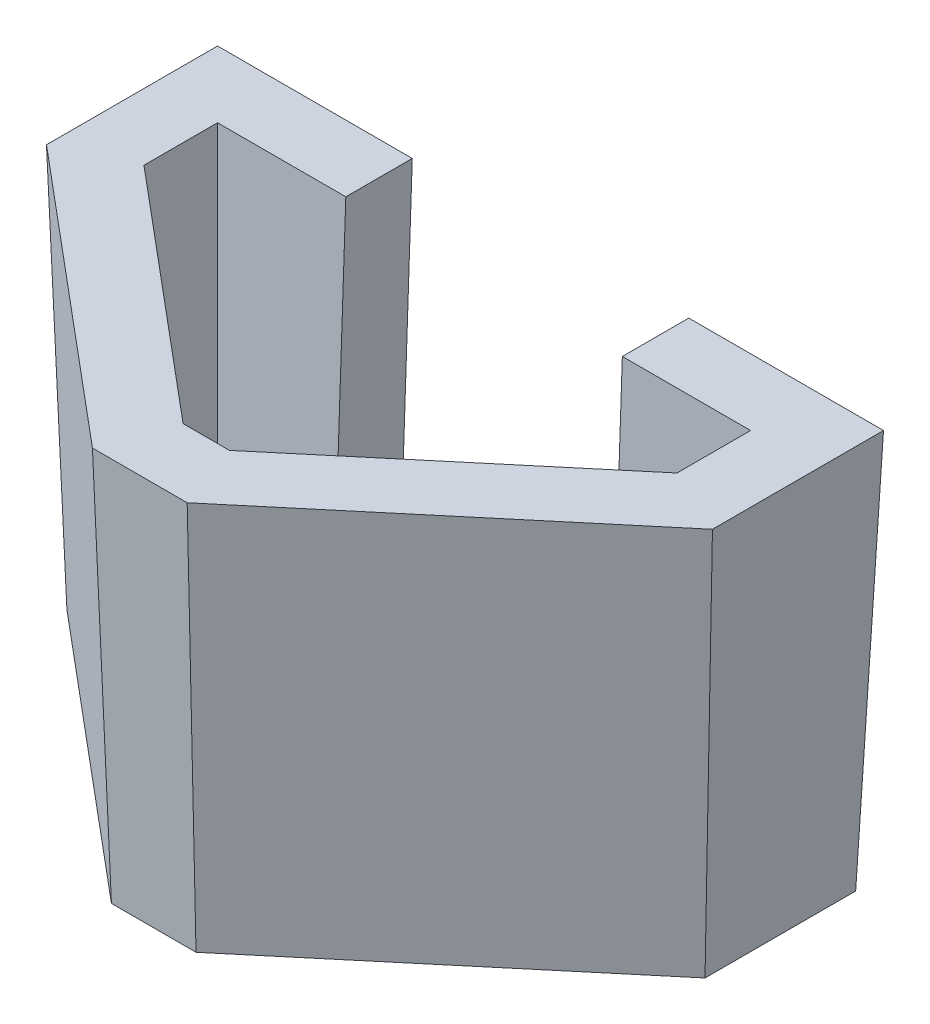
ISO-10303-21;
HEADER;
FILE_DESCRIPTION(('STEP AP214'),'2;1');
FILE_NAME('part.step','',(''),(''),'','','');
FILE_SCHEMA(('AUTOMOTIVE_DESIGN { 1 0 10303 214 1 1 1 1 }'));
ENDSEC;
DATA;
#1=APPLICATION_CONTEXT('core data for automotive mechanical design processes');
#2=APPLICATION_PROTOCOL_DEFINITION('international standard','automotive_design',2000,#1);
#3=PRODUCT_CONTEXT('',#1,'mechanical');
#4=PRODUCT('Part','Part','',(#3));
#5=PRODUCT_RELATED_PRODUCT_CATEGORY('part','',(#4));
#6=PRODUCT_DEFINITION_FORMATION('','',#4);
#7=PRODUCT_DEFINITION_CONTEXT('part definition',#1,'design');
#8=PRODUCT_DEFINITION('design','',#6,#7);
#9=PRODUCT_DEFINITION_SHAPE('','',#8);
#10=(LENGTH_UNIT() NAMED_UNIT(*) SI_UNIT(.MILLI.,.METRE.));
#11=(NAMED_UNIT(*) PLANE_ANGLE_UNIT() SI_UNIT($,.RADIAN.));
#12=(NAMED_UNIT(*) SI_UNIT($,.STERADIAN.) SOLID_ANGLE_UNIT());
#13=UNCERTAINTY_MEASURE_WITH_UNIT(LENGTH_MEASURE(1.E-05),#10,'distance_accuracy_value','');
#14=(GEOMETRIC_REPRESENTATION_CONTEXT(3) GLOBAL_UNCERTAINTY_ASSIGNED_CONTEXT((#13)) GLOBAL_UNIT_ASSIGNED_CONTEXT((#10,
#11,#12)) REPRESENTATION_CONTEXT('',''));
#15=CARTESIAN_POINT('',(0.,0.,0.));
#16=DIRECTION('',(0.,0.,1.));
#17=DIRECTION('',(1.,0.,0.));
#18=AXIS2_PLACEMENT_3D('',#15,#16,#17);
#19=CARTESIAN_POINT('',(-12.5,0.,-12.5));
#20=DIRECTION('',(0.,-0.034899496702501,-0.999390827019096));
#21=DIRECTION('',(0.,0.999390827019096,-0.034899496702501));
#22=AXIS2_PLACEMENT_3D('',#19,#20,#21);
#23=PLANE('',#22);
#24=DIRECTION('',(-1.,0.,0.));
#25=VECTOR('',#24,1.);
#26=CARTESIAN_POINT('',(-12.5,0.,-12.5));
#27=LINE('',#26,#25);
#28=CARTESIAN_POINT('',(107.5,0.,-12.5));
#29=VERTEX_POINT('',#28);
#30=CARTESIAN_POINT('',(73.5,0.,-12.5));
#31=VERTEX_POINT('',#30);
#32=EDGE_CURVE('E226',#29,#31,#27,.T.);
#33=ORIENTED_EDGE('',*,*,#32,.T.);
#34=DIRECTION('',(0.,-0.999390827019096,0.034899496702501));
#35=VECTOR('',#34,1.);
#36=CARTESIAN_POINT('',(73.5,75.4359779609008,-15.1342823977572));
#37=LINE('',#36,#35);
#38=CARTESIAN_POINT('',(73.5,75.,-15.1190577118811));
#39=VERTEX_POINT('',#38);
#40=EDGE_CURVE('E306',#39,#31,#37,.T.);
#41=ORIENTED_EDGE('',*,*,#40,.F.);
#42=DIRECTION('',(1.,0.,0.));
#43=VECTOR('',#42,1.);
#44=CARTESIAN_POINT('',(0.,75.,-15.1190577118811));
#45=LINE('',#44,#43);
#46=CARTESIAN_POINT('',(110.119057711881,75.,-15.1190577118811));
#47=VERTEX_POINT('',#46);
#48=EDGE_CURVE('E240',#47,#39,#45,.F.);
#49=ORIENTED_EDGE('',*,*,#48,.F.);
#50=DIRECTION('',(-0.0348782627423747,-0.998782765958718,0.0348782627423747));
#51=VECTOR('',#50,1.);
#52=CARTESIAN_POINT('',(107.354020814569,-4.18029692803967,-12.3540208145689));
#53=LINE('',#52,#51);
#54=EDGE_CURVE('E239',#47,#29,#53,.T.);
#55=ORIENTED_EDGE('',*,*,#54,.T.);
#56=EDGE_LOOP('',(#33,#41,#49,#55));
#57=FACE_BOUND('',#56,.T.);
#58=ADVANCED_FACE('F43',(#57),#23,.T.);
#59=CARTESIAN_POINT('',(97.6190577118811,75.,-2.61905771188108));
#60=DIRECTION('',(0.,-0.034899496702501,-0.999390827019096));
#61=DIRECTION('',(0.,0.999390827019096,-0.034899496702501));
#62=AXIS2_PLACEMENT_3D('',#59,#60,#61);
#63=PLANE('',#62);
#64=DIRECTION('',(-1.,0.,0.));
#65=VECTOR('',#64,1.);
#66=CARTESIAN_POINT('',(97.6190577118811,75.,-2.61905771188108));
#67=LINE('',#66,#65);
#68=CARTESIAN_POINT('',(97.6190577118811,75.,-2.61905771188108));
#69=VERTEX_POINT('',#68);
#70=CARTESIAN_POINT('',(73.5,75.,-2.61905771188109));
#71=VERTEX_POINT('',#70);
#72=EDGE_CURVE('E320',#69,#71,#67,.T.);
#73=ORIENTED_EDGE('',*,*,#72,.T.);
#74=DIRECTION('',(0.,-0.999390827019096,0.034899496702501));
#75=VECTOR('',#74,1.);
#76=CARTESIAN_POINT('',(73.5,75.,-2.61905771188108));
#77=LINE('',#76,#75);
#78=CARTESIAN_POINT('',(73.5,0.,0.));
#79=VERTEX_POINT('',#78);
#80=EDGE_CURVE('E11',#71,#79,#77,.T.);
#81=ORIENTED_EDGE('',*,*,#80,.T.);
#82=DIRECTION('',(-1.,0.,0.));
#83=VECTOR('',#82,1.);
#84=CARTESIAN_POINT('',(0.,0.,0.));
#85=LINE('',#84,#83);
#86=CARTESIAN_POINT('',(95.,0.,0.));
#87=VERTEX_POINT('',#86);
#88=EDGE_CURVE('E177',#87,#79,#85,.T.);
#89=ORIENTED_EDGE('',*,*,#88,.F.);
#90=DIRECTION('',(0.0348782627423747,0.998782765958718,-0.0348782627423747));
#91=VECTOR('',#90,1.);
#92=CARTESIAN_POINT('',(97.602221026892,74.5178604242078,-2.602221026892));
#93=LINE('',#92,#91);
#94=EDGE_CURVE('E214',#87,#69,#93,.T.);
#95=ORIENTED_EDGE('',*,*,#94,.T.);
#96=EDGE_LOOP('',(#73,#81,#89,#95));
#97=FACE_BOUND('',#96,.T.);
#98=ADVANCED_FACE('F362',(#97),#63,.F.);
#99=CARTESIAN_POINT('',(-12.5,0.,15.8288457269375));
#100=DIRECTION('',(-0.999390827019096,-0.034899496702501,0.));
#101=DIRECTION('',(0.034899496702501,-0.999390827019096,0.));
#102=AXIS2_PLACEMENT_3D('',#99,#100,#101);
#103=PLANE('',#102);
#104=DIRECTION('',(0.,0.,1.));
#105=VECTOR('',#104,1.);
#106=CARTESIAN_POINT('',(-12.5,0.,15.8288457269375));
#107=LINE('',#106,#105);
#108=CARTESIAN_POINT('',(-12.5,0.,-12.5));
#109=VERTEX_POINT('',#108);
#110=CARTESIAN_POINT('',(-12.5,0.,15.8288457269375));
#111=VERTEX_POINT('',#110);
#112=EDGE_CURVE('E209',#109,#111,#107,.T.);
#113=ORIENTED_EDGE('',*,*,#112,.T.);
#114=DIRECTION('',(0.034894876230547,-0.999258514013935,-0.016271748016675));
#115=VECTOR('',#114,1.);
#116=CARTESIAN_POINT('',(-12.4614234800568,-1.10468699586631,15.8108572002631));
#117=LINE('',#116,#115);
#118=CARTESIAN_POINT('',(-15.1190577118811,75.,17.0501323951376));
#119=VERTEX_POINT('',#118);
#120=EDGE_CURVE('E161',#119,#111,#117,.T.);
#121=ORIENTED_EDGE('',*,*,#120,.F.);
#122=DIRECTION('',(0.,0.,-1.));
#123=VECTOR('',#122,1.);
#124=CARTESIAN_POINT('',(-15.1190577118811,75.,0.));
#125=LINE('',#124,#123);
#126=CARTESIAN_POINT('',(-15.1190577118811,75.,-15.1190577118811));
#127=VERTEX_POINT('',#126);
#128=EDGE_CURVE('E230',#127,#119,#125,.F.);
#129=ORIENTED_EDGE('',*,*,#128,.F.);
#130=DIRECTION('',(0.0348782627423747,-0.998782765958718,0.0348782627423747));
#131=VECTOR('',#130,1.);
#132=CARTESIAN_POINT('',(-12.4655381514715,-0.986858223060223,-12.4655381514715));
#133=LINE('',#132,#131);
#134=EDGE_CURVE('E235',#127,#109,#133,.T.);
#135=ORIENTED_EDGE('',*,*,#134,.T.);
#136=EDGE_LOOP('',(#113,#121,#129,#135));
#137=FACE_BOUND('',#136,.T.);
#138=ADVANCED_FACE('F285',(#137),#103,.T.);
#139=CARTESIAN_POINT('',(39.5452549976588,0.,59.5));
#140=DIRECTION('',(-0.642396040842254,-0.034899496702501,0.765577789542062));
#141=DIRECTION('',(0.766044443118982,0.,0.642787609686535));
#142=AXIS2_PLACEMENT_3D('',#139,#140,#141);
#143=PLANE('',#142);
#144=DIRECTION('',(0.766044443118982,0.,0.642787609686535));
#145=VECTOR('',#144,1.);
#146=CARTESIAN_POINT('',(39.5452549976588,0.,59.5));
#147=LINE('',#146,#145);
#148=CARTESIAN_POINT('',(39.5452549976588,0.,59.5));
#149=VERTEX_POINT('',#148);
#150=EDGE_CURVE('E213',#111,#149,#147,.T.);
#151=ORIENTED_EDGE('',*,*,#150,.T.);
#152=DIRECTION('',(0.0127013533476481,-0.999310210716416,-0.0348966815191779));
#153=VECTOR('',#152,1.);
#154=CARTESIAN_POINT('',(39.54782158622,-0.201932666992896,59.4929483558831));
#155=LINE('',#154,#153);
#156=CARTESIAN_POINT('',(38.5919959487087,75.,62.1190577118811));
#157=VERTEX_POINT('',#156);
#158=EDGE_CURVE('E234',#157,#149,#155,.T.);
#159=ORIENTED_EDGE('',*,*,#158,.F.);
#160=DIRECTION('',(-0.766044443118982,0.,-0.642787609686535));
#161=VECTOR('',#160,1.);
#162=CARTESIAN_POINT('',(-14.6423817323938,75.,17.4501110337164));
#163=LINE('',#162,#161);
#164=EDGE_CURVE('E258',#119,#157,#163,.F.);
#165=ORIENTED_EDGE('',*,*,#164,.F.);
#166=ORIENTED_EDGE('',*,*,#120,.T.);
#167=EDGE_LOOP('',(#151,#159,#165,#166));
#168=FACE_BOUND('',#167,.T.);
#169=ADVANCED_FACE('F45',(#168),#143,.T.);
#170=CARTESIAN_POINT('',(55.4547450023412,0.,59.5));
#171=DIRECTION('',(0.,-0.034899496702501,0.999390827019096));
#172=DIRECTION('',(0.,-0.999390827019096,-0.034899496702501));
#173=AXIS2_PLACEMENT_3D('',#170,#171,#172);
#174=PLANE('',#173);
#175=DIRECTION('',(1.,0.,0.));
#176=VECTOR('',#175,1.);
#177=CARTESIAN_POINT('',(55.4547450023412,0.,59.5));
#178=LINE('',#177,#176);
#179=CARTESIAN_POINT('',(55.4547450023412,0.,59.5));
#180=VERTEX_POINT('',#179);
#181=EDGE_CURVE('E217',#149,#180,#178,.T.);
#182=ORIENTED_EDGE('',*,*,#181,.T.);
#183=DIRECTION('',(-0.0127013533476481,-0.999310210716416,-0.0348966815191779));
#184=VECTOR('',#183,1.);
#185=CARTESIAN_POINT('',(55.4437845829993,-0.862337946382392,59.4698864953504));
#186=LINE('',#185,#184);
#187=CARTESIAN_POINT('',(56.4080040512913,75.,62.1190577118811));
#188=VERTEX_POINT('',#187);
#189=EDGE_CURVE('E248',#188,#180,#186,.T.);
#190=ORIENTED_EDGE('',*,*,#189,.F.);
#191=DIRECTION('',(-1.,0.,0.));
#192=VECTOR('',#191,1.);
#193=CARTESIAN_POINT('',(0.,75.,62.1190577118811));
#194=LINE('',#193,#192);
#195=EDGE_CURVE('E261',#157,#188,#194,.F.);
#196=ORIENTED_EDGE('',*,*,#195,.F.);
#197=ORIENTED_EDGE('',*,*,#158,.T.);
#198=EDGE_LOOP('',(#182,#190,#196,#197));
#199=FACE_BOUND('',#198,.T.);
#200=ADVANCED_FACE('F293',(#199),#174,.T.);
#201=CARTESIAN_POINT('',(107.5,0.,15.8288457269375));
#202=DIRECTION('',(0.642396040842254,-0.034899496702501,0.765577789542062));
#203=DIRECTION('',(0.766044443118981,0.,-0.642787609686535));
#204=AXIS2_PLACEMENT_3D('',#201,#202,#203);
#205=PLANE('',#204);
#206=DIRECTION('',(0.766044443118981,0.,-0.642787609686535));
#207=VECTOR('',#206,1.);
#208=CARTESIAN_POINT('',(107.5,0.,15.8288457269375));
#209=LINE('',#208,#207);
#210=CARTESIAN_POINT('',(107.5,0.,15.8288457269375));
#211=VERTEX_POINT('',#210);
#212=EDGE_CURVE('E220',#180,#211,#209,.T.);
#213=ORIENTED_EDGE('',*,*,#212,.T.);
#214=DIRECTION('',(-0.0348948762305471,-0.999258514013935,-0.016271748016675));
#215=VECTOR('',#214,1.);
#216=CARTESIAN_POINT('',(107.483914863461,-0.460618044011029,15.8213451045871));
#217=LINE('',#216,#215);
#218=CARTESIAN_POINT('',(110.119057711881,75.,17.0501323951376));
#219=VERTEX_POINT('',#218);
#220=EDGE_CURVE('E244',#219,#211,#217,.T.);
#221=ORIENTED_EDGE('',*,*,#220,.F.);
#222=DIRECTION('',(-0.766044443118981,0.,0.642787609686535));
#223=VECTOR('',#222,1.);
#224=CARTESIAN_POINT('',(53.8940932932142,75.,64.2284793017962));
#225=LINE('',#224,#223);
#226=EDGE_CURVE('E264',#188,#219,#225,.F.);
#227=ORIENTED_EDGE('',*,*,#226,.F.);
#228=ORIENTED_EDGE('',*,*,#189,.T.);
#229=EDGE_LOOP('',(#213,#221,#227,#228));
#230=FACE_BOUND('',#229,.T.);
#231=ADVANCED_FACE('F297',(#230),#205,.T.);
#232=CARTESIAN_POINT('',(107.5,0.,-12.5));
#233=DIRECTION('',(0.999390827019096,-0.034899496702501,0.));
#234=DIRECTION('',(0.0348994967025011,0.999390827019096,0.));
#235=AXIS2_PLACEMENT_3D('',#232,#233,#234);
#236=PLANE('',#235);
#237=DIRECTION('',(0.,0.,-1.));
#238=VECTOR('',#237,1.);
#239=CARTESIAN_POINT('',(107.5,0.,-12.5));
#240=LINE('',#239,#238);
#241=EDGE_CURVE('E223',#211,#29,#240,.T.);
#242=ORIENTED_EDGE('',*,*,#241,.T.);
#243=ORIENTED_EDGE('',*,*,#54,.F.);
#244=DIRECTION('',(0.,0.,1.));
#245=VECTOR('',#244,1.);
#246=CARTESIAN_POINT('',(110.119057711881,75.,0.));
#247=LINE('',#246,#245);
#248=EDGE_CURVE('E267',#219,#47,#247,.F.);
#249=ORIENTED_EDGE('',*,*,#248,.F.);
#250=ORIENTED_EDGE('',*,*,#220,.T.);
#251=EDGE_LOOP('',(#242,#243,#249,#250));
#252=FACE_BOUND('',#251,.T.);
#253=ADVANCED_FACE('F302',(#252),#236,.T.);
#254=CARTESIAN_POINT('',(21.5,75.,-15.1190577118811));
#255=VERTEX_POINT('',#254);
#256=EDGE_CURVE('E270',#255,#127,#45,.F.);
#257=ORIENTED_EDGE('',*,*,#256,.F.);
#258=DIRECTION('',(0.,-0.999390827019096,0.034899496702501));
#259=VECTOR('',#258,1.);
#260=CARTESIAN_POINT('',(21.5,75.4359779609008,-15.1342823977572));
#261=LINE('',#260,#259);
#262=CARTESIAN_POINT('',(21.5,0.,-12.5));
#263=VERTEX_POINT('',#262);
#264=EDGE_CURVE('E308',#255,#263,#261,.T.);
#265=ORIENTED_EDGE('',*,*,#264,.T.);
#266=EDGE_CURVE('E169',#263,#109,#27,.T.);
#267=ORIENTED_EDGE('',*,*,#266,.T.);
#268=ORIENTED_EDGE('',*,*,#134,.F.);
#269=EDGE_LOOP('',(#257,#265,#267,#268));
#270=FACE_BOUND('',#269,.T.);
#271=ADVANCED_FACE('F283',(#270),#23,.T.);
#272=CARTESIAN_POINT('',(0.,75.,0.));
#273=DIRECTION('',(0.,-1.,0.));
#274=DIRECTION('',(0.,0.,-1.));
#275=AXIS2_PLACEMENT_3D('',#272,#273,#274);
#276=PLANE('',#275);
#277=ORIENTED_EDGE('',*,*,#48,.T.);
#278=DIRECTION('',(0.,0.,1.));
#279=VECTOR('',#278,1.);
#280=CARTESIAN_POINT('',(73.5,75.,0.));
#281=LINE('',#280,#279);
#282=EDGE_CURVE('E312',#39,#71,#281,.T.);
#283=ORIENTED_EDGE('',*,*,#282,.T.);
#284=ORIENTED_EDGE('',*,*,#72,.F.);
#285=DIRECTION('',(0.,0.,-1.));
#286=VECTOR('',#285,1.);
#287=CARTESIAN_POINT('',(97.6190577118811,75.,11.2212866682001));
#288=LINE('',#287,#286);
#289=CARTESIAN_POINT('',(97.6190577118811,75.,11.2212866682001));
#290=VERTEX_POINT('',#289);
#291=EDGE_CURVE('E178',#290,#69,#288,.T.);
#292=ORIENTED_EDGE('',*,*,#291,.F.);
#293=DIRECTION('',(0.766044443118981,0.,-0.642787609686535));
#294=VECTOR('',#293,1.);
#295=CARTESIAN_POINT('',(51.8583761229638,75.,49.6190577118811));
#296=LINE('',#295,#294);
#297=CARTESIAN_POINT('',(51.8583761229638,75.,49.6190577118811));
#298=VERTEX_POINT('',#297);
#299=EDGE_CURVE('E185',#298,#290,#296,.T.);
#300=ORIENTED_EDGE('',*,*,#299,.F.);
#301=DIRECTION('',(1.,0.,0.));
#302=VECTOR('',#301,1.);
#303=CARTESIAN_POINT('',(43.1416238770362,75.,49.6190577118811));
#304=LINE('',#303,#302);
#305=CARTESIAN_POINT('',(43.1416238770362,75.,49.6190577118811));
#306=VERTEX_POINT('',#305);
#307=EDGE_CURVE('E332',#306,#298,#304,.T.);
#308=ORIENTED_EDGE('',*,*,#307,.F.);
#309=DIRECTION('',(0.766044443118982,0.,0.642787609686535));
#310=VECTOR('',#309,1.);
#311=CARTESIAN_POINT('',(-2.61905771188108,75.,11.2212866682001));
#312=LINE('',#311,#310);
#313=CARTESIAN_POINT('',(-2.61905771188108,75.,11.2212866682001));
#314=VERTEX_POINT('',#313);
#315=EDGE_CURVE('E328',#314,#306,#312,.T.);
#316=ORIENTED_EDGE('',*,*,#315,.F.);
#317=DIRECTION('',(0.,0.,1.));
#318=VECTOR('',#317,1.);
#319=CARTESIAN_POINT('',(-2.61905771188108,75.,-2.61905771188108));
#320=LINE('',#319,#318);
#321=CARTESIAN_POINT('',(-2.61905771188108,75.,-2.61905771188108));
#322=VERTEX_POINT('',#321);
#323=EDGE_CURVE('E324',#322,#314,#320,.T.);
#324=ORIENTED_EDGE('',*,*,#323,.F.);
#325=CARTESIAN_POINT('',(21.5,75.,-2.61905771188108));
#326=VERTEX_POINT('',#325);
#327=EDGE_CURVE('E319',#326,#322,#67,.T.);
#328=ORIENTED_EDGE('',*,*,#327,.F.);
#329=DIRECTION('',(0.,0.,-1.));
#330=VECTOR('',#329,1.);
#331=CARTESIAN_POINT('',(21.5,75.,0.));
#332=LINE('',#331,#330);
#333=EDGE_CURVE('E66',#326,#255,#332,.T.);
#334=ORIENTED_EDGE('',*,*,#333,.T.);
#335=ORIENTED_EDGE('',*,*,#256,.T.);
#336=ORIENTED_EDGE('',*,*,#128,.T.);
#337=ORIENTED_EDGE('',*,*,#164,.T.);
#338=ORIENTED_EDGE('',*,*,#195,.T.);
#339=ORIENTED_EDGE('',*,*,#226,.T.);
#340=ORIENTED_EDGE('',*,*,#248,.T.);
#341=EDGE_LOOP('',(#277,#283,#284,#292,#300,#308,#316,#324,#328,#334,#335,#336,#337,#338,#339,#340));
#342=FACE_BOUND('',#341,.T.);
#343=ADVANCED_FACE('F279',(#342),#276,.F.);
#344=CARTESIAN_POINT('',(0.,0.,0.));
#345=DIRECTION('',(0.,-1.,0.));
#346=DIRECTION('',(0.,0.,-1.));
#347=AXIS2_PLACEMENT_3D('',#344,#345,#346);
#348=PLANE('',#347);
#349=DIRECTION('',(0.,0.,1.));
#350=VECTOR('',#349,1.);
#351=CARTESIAN_POINT('',(73.5,0.,-12.5));
#352=LINE('',#351,#350);
#353=EDGE_CURVE('E59',#31,#79,#352,.T.);
#354=ORIENTED_EDGE('',*,*,#353,.F.);
#355=ORIENTED_EDGE('',*,*,#32,.F.);
#356=ORIENTED_EDGE('',*,*,#241,.F.);
#357=ORIENTED_EDGE('',*,*,#212,.F.);
#358=ORIENTED_EDGE('',*,*,#181,.F.);
#359=ORIENTED_EDGE('',*,*,#150,.F.);
#360=ORIENTED_EDGE('',*,*,#112,.F.);
#361=ORIENTED_EDGE('',*,*,#266,.F.);
#362=DIRECTION('',(0.,0.,-1.));
#363=VECTOR('',#362,1.);
#364=CARTESIAN_POINT('',(21.5,0.,0.));
#365=LINE('',#364,#363);
#366=CARTESIAN_POINT('',(21.5,0.,0.));
#367=VERTEX_POINT('',#366);
#368=EDGE_CURVE('E155',#367,#263,#365,.T.);
#369=ORIENTED_EDGE('',*,*,#368,.F.);
#370=CARTESIAN_POINT('',(0.,0.,0.));
#371=VERTEX_POINT('',#370);
#372=EDGE_CURVE('E166',#367,#371,#85,.T.);
#373=ORIENTED_EDGE('',*,*,#372,.T.);
#374=DIRECTION('',(0.,0.,1.));
#375=VECTOR('',#374,1.);
#376=CARTESIAN_POINT('',(0.,0.,0.));
#377=LINE('',#376,#375);
#378=CARTESIAN_POINT('',(0.,0.,10.));
#379=VERTEX_POINT('',#378);
#380=EDGE_CURVE('E183',#371,#379,#377,.T.);
#381=ORIENTED_EDGE('',*,*,#380,.T.);
#382=DIRECTION('',(0.766044443118982,0.,0.642787609686535));
#383=VECTOR('',#382,1.);
#384=CARTESIAN_POINT('',(-4.92403876506103,0.,5.86824088833471));
#385=LINE('',#384,#383);
#386=CARTESIAN_POINT('',(44.0948829259863,0.,47.));
#387=VERTEX_POINT('',#386);
#388=EDGE_CURVE('E203',#379,#387,#385,.T.);
#389=ORIENTED_EDGE('',*,*,#388,.T.);
#390=DIRECTION('',(1.,0.,0.));
#391=VECTOR('',#390,1.);
#392=CARTESIAN_POINT('',(0.,0.,47.));
#393=LINE('',#392,#391);
#394=CARTESIAN_POINT('',(50.9051170740137,0.,47.));
#395=VERTEX_POINT('',#394);
#396=EDGE_CURVE('E199',#387,#395,#393,.T.);
#397=ORIENTED_EDGE('',*,*,#396,.T.);
#398=DIRECTION('',(0.766044443118981,0.,-0.642787609686535));
#399=VECTOR('',#398,1.);
#400=CARTESIAN_POINT('',(44.1757503258813,0.,52.6466091564145));
#401=LINE('',#400,#399);
#402=CARTESIAN_POINT('',(95.,0.,9.99999999999999));
#403=VERTEX_POINT('',#402);
#404=EDGE_CURVE('E195',#395,#403,#401,.T.);
#405=ORIENTED_EDGE('',*,*,#404,.T.);
#406=DIRECTION('',(0.,0.,-1.));
#407=VECTOR('',#406,1.);
#408=CARTESIAN_POINT('',(95.,0.,0.));
#409=LINE('',#408,#407);
#410=EDGE_CURVE('E191',#403,#87,#409,.T.);
#411=ORIENTED_EDGE('',*,*,#410,.T.);
#412=ORIENTED_EDGE('',*,*,#88,.T.);
#413=EDGE_LOOP('',(#354,#355,#356,#357,#358,#359,#360,#361,#369,#373,#381,#389,#397,#405,#411,#412));
#414=FACE_BOUND('',#413,.T.);
#415=ADVANCED_FACE('F164',(#414),#348,.T.);
#416=ORIENTED_EDGE('',*,*,#372,.F.);
#417=DIRECTION('',(0.,0.999390827019096,-0.034899496702501));
#418=VECTOR('',#417,1.);
#419=CARTESIAN_POINT('',(21.5,75.,-2.61905771188108));
#420=LINE('',#419,#418);
#421=EDGE_CURVE('E52',#367,#326,#420,.T.);
#422=ORIENTED_EDGE('',*,*,#421,.T.);
#423=ORIENTED_EDGE('',*,*,#327,.T.);
#424=DIRECTION('',(-0.0348782627423747,0.998782765958718,-0.0348782627423747));
#425=VECTOR('',#424,1.);
#426=CARTESIAN_POINT('',(-2.49711872489182,71.508124283513,-2.49711872489181));
#427=LINE('',#426,#425);
#428=EDGE_CURVE('E174',#371,#322,#427,.T.);
#429=ORIENTED_EDGE('',*,*,#428,.F.);
#430=EDGE_LOOP('',(#416,#422,#423,#429));
#431=FACE_BOUND('',#430,.T.);
#432=ADVANCED_FACE('F172',(#431),#63,.F.);
#433=CARTESIAN_POINT('',(97.6190577118811,75.,11.2212866682001));
#434=DIRECTION('',(0.999390827019096,-0.034899496702501,0.));
#435=DIRECTION('',(0.034899496702501,0.999390827019096,0.));
#436=AXIS2_PLACEMENT_3D('',#433,#434,#435);
#437=PLANE('',#436);
#438=ORIENTED_EDGE('',*,*,#291,.T.);
#439=ORIENTED_EDGE('',*,*,#94,.F.);
#440=ORIENTED_EDGE('',*,*,#410,.F.);
#441=DIRECTION('',(0.034894876230547,0.999258514013934,0.016271748016675));
#442=VECTOR('',#441,1.);
#443=CARTESIAN_POINT('',(97.5851393874151,74.0287062696584,11.2054702937497));
#444=LINE('',#443,#442);
#445=EDGE_CURVE('E189',#403,#290,#444,.T.);
#446=ORIENTED_EDGE('',*,*,#445,.T.);
#447=EDGE_LOOP('',(#438,#439,#440,#446));
#448=FACE_BOUND('',#447,.T.);
#449=ADVANCED_FACE('F355',(#448),#437,.F.);
#450=CARTESIAN_POINT('',(51.8583761229638,75.,49.6190577118811));
#451=DIRECTION('',(0.642396040842254,-0.034899496702501,0.765577789542062));
#452=DIRECTION('',(0.766044443118981,0.,-0.642787609686535));
#453=AXIS2_PLACEMENT_3D('',#450,#451,#452);
#454=PLANE('',#453);
#455=ORIENTED_EDGE('',*,*,#299,.T.);
#456=ORIENTED_EDGE('',*,*,#445,.F.);
#457=ORIENTED_EDGE('',*,*,#404,.F.);
#458=DIRECTION('',(0.0127013533476481,0.999310210716416,0.0348966815191779));
#459=VECTOR('',#458,1.);
#460=CARTESIAN_POINT('',(51.8569698983395,74.8893618193909,49.615194141479));
#461=LINE('',#460,#459);
#462=EDGE_CURVE('E348',#395,#298,#461,.T.);
#463=ORIENTED_EDGE('',*,*,#462,.T.);
#464=EDGE_LOOP('',(#455,#456,#457,#463));
#465=FACE_BOUND('',#464,.T.);
#466=ADVANCED_FACE('F359',(#465),#454,.F.);
#467=CARTESIAN_POINT('',(43.1416238770362,75.,49.6190577118811));
#468=DIRECTION('',(0.,-0.034899496702501,0.999390827019096));
#469=DIRECTION('',(0.,-0.999390827019096,-0.034899496702501));
#470=AXIS2_PLACEMENT_3D('',#467,#468,#469);
#471=PLANE('',#470);
#472=ORIENTED_EDGE('',*,*,#307,.T.);
#473=ORIENTED_EDGE('',*,*,#462,.F.);
#474=ORIENTED_EDGE('',*,*,#396,.F.);
#475=DIRECTION('',(-0.0127013533476481,0.999310210716416,0.0348966815191779));
#476=VECTOR('',#475,1.);
#477=CARTESIAN_POINT('',(43.1512608028157,74.2417911644737,49.592580475909));
#478=LINE('',#477,#476);
#479=EDGE_CURVE('E346',#387,#306,#478,.T.);
#480=ORIENTED_EDGE('',*,*,#479,.T.);
#481=EDGE_LOOP('',(#472,#473,#474,#480));
#482=FACE_BOUND('',#481,.T.);
#483=ADVANCED_FACE('F366',(#482),#471,.F.);
#484=CARTESIAN_POINT('',(-2.61905771188108,75.,11.2212866682001));
#485=DIRECTION('',(-0.642396040842254,-0.034899496702501,0.765577789542062));
#486=DIRECTION('',(0.766044443118982,0.,0.642787609686535));
#487=AXIS2_PLACEMENT_3D('',#484,#485,#486);
#488=PLANE('',#487);
#489=ORIENTED_EDGE('',*,*,#315,.T.);
#490=ORIENTED_EDGE('',*,*,#479,.F.);
#491=ORIENTED_EDGE('',*,*,#388,.F.);
#492=DIRECTION('',(-0.0348948762305471,0.999258514013935,0.016271748016675));
#493=VECTOR('',#492,1.);
#494=CARTESIAN_POINT('',(-2.6111991555798,74.7749603913184,11.2176221632147));
#495=LINE('',#494,#493);
#496=EDGE_CURVE('E343',#379,#314,#495,.T.);
#497=ORIENTED_EDGE('',*,*,#496,.T.);
#498=EDGE_LOOP('',(#489,#490,#491,#497));
#499=FACE_BOUND('',#498,.T.);
#500=ADVANCED_FACE('F370',(#499),#488,.F.);
#501=CARTESIAN_POINT('',(-2.61905771188108,75.,-2.61905771188108));
#502=DIRECTION('',(-0.999390827019096,-0.034899496702501,0.));
#503=DIRECTION('',(0.034899496702501,-0.999390827019096,0.));
#504=AXIS2_PLACEMENT_3D('',#501,#502,#503);
#505=PLANE('',#504);
#506=ORIENTED_EDGE('',*,*,#323,.T.);
#507=ORIENTED_EDGE('',*,*,#496,.F.);
#508=ORIENTED_EDGE('',*,*,#380,.F.);
#509=ORIENTED_EDGE('',*,*,#428,.T.);
#510=EDGE_LOOP('',(#506,#507,#508,#509));
#511=FACE_BOUND('',#510,.T.);
#512=ADVANCED_FACE('F373',(#511),#505,.F.);
#513=CARTESIAN_POINT('',(21.5,75.4359779609008,-2.63428239775719));
#514=DIRECTION('',(-1.,0.,0.));
#515=DIRECTION('',(0.,0.,1.));
#516=AXIS2_PLACEMENT_3D('',#513,#514,#515);
#517=PLANE('',#516);
#518=ORIENTED_EDGE('',*,*,#421,.F.);
#519=ORIENTED_EDGE('',*,*,#368,.T.);
#520=ORIENTED_EDGE('',*,*,#264,.F.);
#521=ORIENTED_EDGE('',*,*,#333,.F.);
#522=EDGE_LOOP('',(#518,#519,#520,#521));
#523=FACE_BOUND('',#522,.T.);
#524=ADVANCED_FACE('F154',(#523),#517,.F.);
#525=CARTESIAN_POINT('',(73.5,75.4359779609008,-15.1342823977572));
#526=DIRECTION('',(1.,0.,0.));
#527=DIRECTION('',(0.,0.,-1.));
#528=AXIS2_PLACEMENT_3D('',#525,#526,#527);
#529=PLANE('',#528);
#530=ORIENTED_EDGE('',*,*,#40,.T.);
#531=ORIENTED_EDGE('',*,*,#353,.T.);
#532=ORIENTED_EDGE('',*,*,#80,.F.);
#533=ORIENTED_EDGE('',*,*,#282,.F.);
#534=EDGE_LOOP('',(#530,#531,#532,#533));
#535=FACE_BOUND('',#534,.T.);
#536=ADVANCED_FACE('F380',(#535),#529,.F.);
#537=CLOSED_SHELL('',(#58,#98,#138,#169,#200,#231,#253,#271,#343,#415,#432,#449,#466,#483,#500,
#512,#524,#536));
#538=MANIFOLD_SOLID_BREP('B2',#537);
#539=ADVANCED_BREP_SHAPE_REPRESENTATION('',(#18,#538),#14);
#540=SHAPE_DEFINITION_REPRESENTATION(#9,#539);
ENDSEC;
END-ISO-10303-21;
